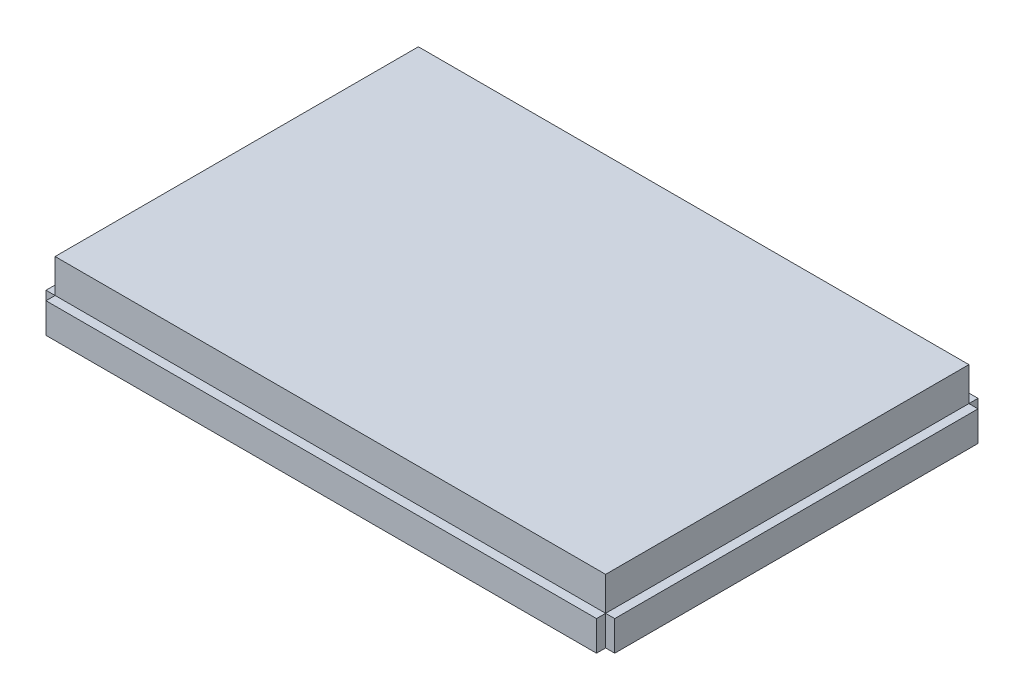
ISO-10303-21;
HEADER;
FILE_DESCRIPTION(('STEP AP214'),'2;1');
FILE_NAME('part.step','',(''),(''),'','','');
FILE_SCHEMA(('AUTOMOTIVE_DESIGN { 1 0 10303 214 1 1 1 1 }'));
ENDSEC;
DATA;
#1=APPLICATION_CONTEXT('core data for automotive mechanical design processes');
#2=APPLICATION_PROTOCOL_DEFINITION('international standard','automotive_design',2000,#1);
#3=PRODUCT_CONTEXT('',#1,'mechanical');
#4=PRODUCT('Part','Part','',(#3));
#5=PRODUCT_RELATED_PRODUCT_CATEGORY('part','',(#4));
#6=PRODUCT_DEFINITION_FORMATION('','',#4);
#7=PRODUCT_DEFINITION_CONTEXT('part definition',#1,'design');
#8=PRODUCT_DEFINITION('design','',#6,#7);
#9=PRODUCT_DEFINITION_SHAPE('','',#8);
#10=(LENGTH_UNIT() NAMED_UNIT(*) SI_UNIT(.MILLI.,.METRE.));
#11=(NAMED_UNIT(*) PLANE_ANGLE_UNIT() SI_UNIT($,.RADIAN.));
#12=(NAMED_UNIT(*) SI_UNIT($,.STERADIAN.) SOLID_ANGLE_UNIT());
#13=UNCERTAINTY_MEASURE_WITH_UNIT(LENGTH_MEASURE(1.E-05),#10,'distance_accuracy_value','');
#14=(GEOMETRIC_REPRESENTATION_CONTEXT(3) GLOBAL_UNCERTAINTY_ASSIGNED_CONTEXT((#13)) GLOBAL_UNIT_ASSIGNED_CONTEXT((#10,
#11,#12)) REPRESENTATION_CONTEXT('',''));
#15=CARTESIAN_POINT('',(0.,0.,0.));
#16=DIRECTION('',(0.,0.,1.));
#17=DIRECTION('',(1.,0.,0.));
#18=AXIS2_PLACEMENT_3D('',#15,#16,#17);
#19=CARTESIAN_POINT('',(-41.1099,9.525,27.1272));
#20=DIRECTION('',(1.,0.,0.));
#21=DIRECTION('',(0.,0.,-1.));
#22=AXIS2_PLACEMENT_3D('',#19,#20,#21);
#23=PLANE('',#22);
#24=DIRECTION('',(0.,0.,-1.));
#25=VECTOR('',#24,1.);
#26=CARTESIAN_POINT('',(-41.1099,4.4831,28.4861));
#27=LINE('',#26,#25);
#28=CARTESIAN_POINT('',(-41.1099,4.4831,28.4861));
#29=VERTEX_POINT('',#28);
#30=CARTESIAN_POINT('',(-41.1099,4.4831,27.1272));
#31=VERTEX_POINT('',#30);
#32=EDGE_CURVE('E232',#29,#31,#27,.T.);
#33=ORIENTED_EDGE('',*,*,#32,.T.);
#34=DIRECTION('',(0.,-1.,0.));
#35=VECTOR('',#34,1.);
#36=CARTESIAN_POINT('',(-41.1099,4.4831,27.1272));
#37=LINE('',#36,#35);
#38=CARTESIAN_POINT('',(-41.1099,0.,27.1272));
#39=VERTEX_POINT('',#38);
#40=EDGE_CURVE('E141',#31,#39,#37,.T.);
#41=ORIENTED_EDGE('',*,*,#40,.T.);
#42=DIRECTION('',(0.,0.,1.));
#43=VECTOR('',#42,1.);
#44=CARTESIAN_POINT('',(-41.1099,0.,27.1272));
#45=LINE('',#44,#43);
#46=CARTESIAN_POINT('',(-41.1099,0.,28.4861));
#47=VERTEX_POINT('',#46);
#48=EDGE_CURVE('E240',#39,#47,#45,.T.);
#49=ORIENTED_EDGE('',*,*,#48,.T.);
#50=DIRECTION('',(0.,-1.,0.));
#51=VECTOR('',#50,1.);
#52=CARTESIAN_POINT('',(-41.1099,4.4831,28.4861));
#53=LINE('',#52,#51);
#54=EDGE_CURVE('E222',#29,#47,#53,.T.);
#55=ORIENTED_EDGE('',*,*,#54,.F.);
#56=EDGE_LOOP('',(#33,#41,#49,#55));
#57=FACE_BOUND('',#56,.T.);
#58=ADVANCED_FACE('F33',(#57),#23,.F.);
#59=CARTESIAN_POINT('',(-41.1099,0.,-28.4861));
#60=VERTEX_POINT('',#59);
#61=CARTESIAN_POINT('',(-41.1099,0.,-27.1272));
#62=VERTEX_POINT('',#61);
#63=EDGE_CURVE('E251',#60,#62,#45,.T.);
#64=ORIENTED_EDGE('',*,*,#63,.T.);
#65=DIRECTION('',(0.,1.,0.));
#66=VECTOR('',#65,1.);
#67=CARTESIAN_POINT('',(-41.1099,4.4831,-27.1272));
#68=LINE('',#67,#66);
#69=CARTESIAN_POINT('',(-41.1099,4.4831,-27.1272));
#70=VERTEX_POINT('',#69);
#71=EDGE_CURVE('E157',#62,#70,#68,.T.);
#72=ORIENTED_EDGE('',*,*,#71,.T.);
#73=DIRECTION('',(0.,0.,1.));
#74=VECTOR('',#73,1.);
#75=CARTESIAN_POINT('',(-41.1099,4.4831,-28.4861));
#76=LINE('',#75,#74);
#77=CARTESIAN_POINT('',(-41.1099,4.4831,-28.4861));
#78=VERTEX_POINT('',#77);
#79=EDGE_CURVE('E218',#78,#70,#76,.T.);
#80=ORIENTED_EDGE('',*,*,#79,.F.);
#81=DIRECTION('',(0.,-1.,0.));
#82=VECTOR('',#81,1.);
#83=CARTESIAN_POINT('',(-41.1099,4.4831,-28.4861));
#84=LINE('',#83,#82);
#85=EDGE_CURVE('E202',#78,#60,#84,.T.);
#86=ORIENTED_EDGE('',*,*,#85,.T.);
#87=EDGE_LOOP('',(#64,#72,#80,#86));
#88=FACE_BOUND('',#87,.T.);
#89=ADVANCED_FACE('F315',(#88),#23,.F.);
#90=CARTESIAN_POINT('',(41.1099,9.525,27.1272));
#91=DIRECTION('',(-1.,0.,0.));
#92=DIRECTION('',(0.,0.,1.));
#93=AXIS2_PLACEMENT_3D('',#90,#91,#92);
#94=PLANE('',#93);
#95=DIRECTION('',(0.,-1.,0.));
#96=VECTOR('',#95,1.);
#97=CARTESIAN_POINT('',(41.1099,4.4831,27.1272));
#98=LINE('',#97,#96);
#99=CARTESIAN_POINT('',(41.1099,4.4831,27.1272));
#100=VERTEX_POINT('',#99);
#101=CARTESIAN_POINT('',(41.1099,0.,27.1272));
#102=VERTEX_POINT('',#101);
#103=EDGE_CURVE('E146',#100,#102,#98,.T.);
#104=ORIENTED_EDGE('',*,*,#103,.F.);
#105=DIRECTION('',(0.,0.,-1.));
#106=VECTOR('',#105,1.);
#107=CARTESIAN_POINT('',(41.1099,4.4831,28.4861));
#108=LINE('',#107,#106);
#109=CARTESIAN_POINT('',(41.1099,4.4831,28.4861));
#110=VERTEX_POINT('',#109);
#111=EDGE_CURVE('E237',#110,#100,#108,.T.);
#112=ORIENTED_EDGE('',*,*,#111,.F.);
#113=DIRECTION('',(0.,1.,0.));
#114=VECTOR('',#113,1.);
#115=CARTESIAN_POINT('',(41.1099,4.4831,28.4861));
#116=LINE('',#115,#114);
#117=CARTESIAN_POINT('',(41.1099,0.,28.4861));
#118=VERTEX_POINT('',#117);
#119=EDGE_CURVE('E228',#118,#110,#116,.T.);
#120=ORIENTED_EDGE('',*,*,#119,.F.);
#121=DIRECTION('',(0.,0.,-1.));
#122=VECTOR('',#121,1.);
#123=CARTESIAN_POINT('',(41.1099,0.,27.1272));
#124=LINE('',#123,#122);
#125=EDGE_CURVE('E56',#118,#102,#124,.T.);
#126=ORIENTED_EDGE('',*,*,#125,.T.);
#127=EDGE_LOOP('',(#104,#112,#120,#126));
#128=FACE_BOUND('',#127,.T.);
#129=ADVANCED_FACE('F317',(#128),#94,.F.);
#130=DIRECTION('',(0.,0.,1.));
#131=VECTOR('',#130,1.);
#132=CARTESIAN_POINT('',(41.1099,4.4831,27.1272));
#133=LINE('',#132,#131);
#134=CARTESIAN_POINT('',(41.1099,4.4831,-27.1272));
#135=VERTEX_POINT('',#134);
#136=EDGE_CURVE('E179',#135,#100,#133,.T.);
#137=ORIENTED_EDGE('',*,*,#136,.F.);
#138=DIRECTION('',(0.,-1.,0.));
#139=VECTOR('',#138,1.);
#140=CARTESIAN_POINT('',(41.1099,9.525,-27.1272));
#141=LINE('',#140,#139);
#142=CARTESIAN_POINT('',(41.1099,9.525,-27.1272));
#143=VERTEX_POINT('',#142);
#144=EDGE_CURVE('E258',#143,#135,#141,.T.);
#145=ORIENTED_EDGE('',*,*,#144,.F.);
#146=DIRECTION('',(0.,0.,-1.));
#147=VECTOR('',#146,1.);
#148=CARTESIAN_POINT('',(41.1099,9.525,27.1272));
#149=LINE('',#148,#147);
#150=CARTESIAN_POINT('',(41.1099,9.525,27.1272));
#151=VERTEX_POINT('',#150);
#152=EDGE_CURVE('E246',#151,#143,#149,.T.);
#153=ORIENTED_EDGE('',*,*,#152,.F.);
#154=DIRECTION('',(0.,-1.,0.));
#155=VECTOR('',#154,1.);
#156=CARTESIAN_POINT('',(41.1099,9.525,27.1272));
#157=LINE('',#156,#155);
#158=EDGE_CURVE('E41',#151,#100,#157,.T.);
#159=ORIENTED_EDGE('',*,*,#158,.T.);
#160=EDGE_LOOP('',(#137,#145,#153,#159));
#161=FACE_BOUND('',#160,.T.);
#162=ADVANCED_FACE('F264',(#161),#94,.F.);
#163=DIRECTION('',(0.,1.,0.));
#164=VECTOR('',#163,1.);
#165=CARTESIAN_POINT('',(41.1099,4.4831,-27.1272));
#166=LINE('',#165,#164);
#167=CARTESIAN_POINT('',(41.1099,0.,-27.1272));
#168=VERTEX_POINT('',#167);
#169=EDGE_CURVE('E48',#168,#135,#166,.T.);
#170=ORIENTED_EDGE('',*,*,#169,.F.);
#171=CARTESIAN_POINT('',(41.1099,0.,-28.4861));
#172=VERTEX_POINT('',#171);
#173=EDGE_CURVE('E254',#168,#172,#124,.T.);
#174=ORIENTED_EDGE('',*,*,#173,.T.);
#175=DIRECTION('',(0.,1.,0.));
#176=VECTOR('',#175,1.);
#177=CARTESIAN_POINT('',(41.1099,4.4831,-28.4861));
#178=LINE('',#177,#176);
#179=CARTESIAN_POINT('',(41.1099,4.4831,-28.4861));
#180=VERTEX_POINT('',#179);
#181=EDGE_CURVE('E208',#172,#180,#178,.T.);
#182=ORIENTED_EDGE('',*,*,#181,.T.);
#183=DIRECTION('',(0.,0.,1.));
#184=VECTOR('',#183,1.);
#185=CARTESIAN_POINT('',(41.1099,4.4831,-28.4861));
#186=LINE('',#185,#184);
#187=EDGE_CURVE('E214',#180,#135,#186,.T.);
#188=ORIENTED_EDGE('',*,*,#187,.T.);
#189=EDGE_LOOP('',(#170,#174,#182,#188));
#190=FACE_BOUND('',#189,.T.);
#191=ADVANCED_FACE('F292',(#190),#94,.F.);
#192=CARTESIAN_POINT('',(41.1099,9.525,27.1272));
#193=DIRECTION('',(0.,0.,-1.));
#194=DIRECTION('',(-1.,0.,0.));
#195=AXIS2_PLACEMENT_3D('',#192,#193,#194);
#196=PLANE('',#195);
#197=DIRECTION('',(-1.,0.,0.));
#198=VECTOR('',#197,1.);
#199=CARTESIAN_POINT('',(-41.1099,4.4831,27.1272));
#200=LINE('',#199,#198);
#201=EDGE_CURVE('E221',#100,#31,#200,.T.);
#202=ORIENTED_EDGE('',*,*,#201,.F.);
#203=ORIENTED_EDGE('',*,*,#158,.F.);
#204=DIRECTION('',(1.,0.,0.));
#205=VECTOR('',#204,1.);
#206=CARTESIAN_POINT('',(41.1099,9.525,27.1272));
#207=LINE('',#206,#205);
#208=CARTESIAN_POINT('',(-41.1099,9.525,27.1272));
#209=VERTEX_POINT('',#208);
#210=EDGE_CURVE('E244',#209,#151,#207,.T.);
#211=ORIENTED_EDGE('',*,*,#210,.F.);
#212=DIRECTION('',(0.,-1.,0.));
#213=VECTOR('',#212,1.);
#214=CARTESIAN_POINT('',(-41.1099,9.525,27.1272));
#215=LINE('',#214,#213);
#216=EDGE_CURVE('E11',#209,#31,#215,.T.);
#217=ORIENTED_EDGE('',*,*,#216,.T.);
#218=EDGE_LOOP('',(#202,#203,#211,#217));
#219=FACE_BOUND('',#218,.T.);
#220=ADVANCED_FACE('F309',(#219),#196,.F.);
#221=DIRECTION('',(0.,-1.,0.));
#222=VECTOR('',#221,1.);
#223=CARTESIAN_POINT('',(-41.1099,9.525,-27.1272));
#224=LINE('',#223,#222);
#225=CARTESIAN_POINT('',(-41.1099,9.525,-27.1272));
#226=VERTEX_POINT('',#225);
#227=EDGE_CURVE('E250',#226,#70,#224,.T.);
#228=ORIENTED_EDGE('',*,*,#227,.T.);
#229=DIRECTION('',(0.,0.,1.));
#230=VECTOR('',#229,1.);
#231=CARTESIAN_POINT('',(-41.1099,4.4831,27.1272));
#232=LINE('',#231,#230);
#233=EDGE_CURVE('E167',#70,#31,#232,.T.);
#234=ORIENTED_EDGE('',*,*,#233,.T.);
#235=ORIENTED_EDGE('',*,*,#216,.F.);
#236=DIRECTION('',(0.,0.,1.));
#237=VECTOR('',#236,1.);
#238=CARTESIAN_POINT('',(-41.1099,9.525,27.1272));
#239=LINE('',#238,#237);
#240=EDGE_CURVE('E241',#226,#209,#239,.T.);
#241=ORIENTED_EDGE('',*,*,#240,.F.);
#242=EDGE_LOOP('',(#228,#234,#235,#241));
#243=FACE_BOUND('',#242,.T.);
#244=ADVANCED_FACE('F35',(#243),#23,.F.);
#245=CARTESIAN_POINT('',(41.1099,9.525,-27.1272));
#246=DIRECTION('',(0.,0.,1.));
#247=DIRECTION('',(1.,0.,0.));
#248=AXIS2_PLACEMENT_3D('',#245,#246,#247);
#249=PLANE('',#248);
#250=ORIENTED_EDGE('',*,*,#144,.T.);
#251=DIRECTION('',(-1.,0.,0.));
#252=VECTOR('',#251,1.);
#253=CARTESIAN_POINT('',(-41.1099,4.4831,-27.1272));
#254=LINE('',#253,#252);
#255=EDGE_CURVE('E201',#135,#70,#254,.T.);
#256=ORIENTED_EDGE('',*,*,#255,.T.);
#257=ORIENTED_EDGE('',*,*,#227,.F.);
#258=DIRECTION('',(-1.,0.,0.));
#259=VECTOR('',#258,1.);
#260=CARTESIAN_POINT('',(41.1099,9.525,-27.1272));
#261=LINE('',#260,#259);
#262=EDGE_CURVE('E248',#143,#226,#261,.T.);
#263=ORIENTED_EDGE('',*,*,#262,.F.);
#264=EDGE_LOOP('',(#250,#256,#257,#263));
#265=FACE_BOUND('',#264,.T.);
#266=ADVANCED_FACE('F302',(#265),#249,.F.);
#267=CARTESIAN_POINT('',(0.,9.525,0.));
#268=DIRECTION('',(0.,1.,0.));
#269=DIRECTION('',(0.,0.,1.));
#270=AXIS2_PLACEMENT_3D('',#267,#268,#269);
#271=PLANE('',#270);
#272=ORIENTED_EDGE('',*,*,#240,.T.);
#273=ORIENTED_EDGE('',*,*,#210,.T.);
#274=ORIENTED_EDGE('',*,*,#152,.T.);
#275=ORIENTED_EDGE('',*,*,#262,.T.);
#276=EDGE_LOOP('',(#272,#273,#274,#275));
#277=FACE_BOUND('',#276,.T.);
#278=ADVANCED_FACE('F308',(#277),#271,.T.);
#279=CARTESIAN_POINT('',(0.,0.,0.));
#280=DIRECTION('',(0.,1.,0.));
#281=DIRECTION('',(0.,0.,1.));
#282=AXIS2_PLACEMENT_3D('',#279,#280,#281);
#283=PLANE('',#282);
#284=ORIENTED_EDGE('',*,*,#63,.F.);
#285=DIRECTION('',(1.,0.,0.));
#286=VECTOR('',#285,1.);
#287=CARTESIAN_POINT('',(-41.1099,0.,-28.4861));
#288=LINE('',#287,#286);
#289=EDGE_CURVE('E211',#60,#172,#288,.T.);
#290=ORIENTED_EDGE('',*,*,#289,.T.);
#291=ORIENTED_EDGE('',*,*,#173,.F.);
#292=DIRECTION('',(-1.,0.,0.));
#293=VECTOR('',#292,1.);
#294=CARTESIAN_POINT('',(42.4688,0.,-27.1272));
#295=LINE('',#294,#293);
#296=CARTESIAN_POINT('',(42.4688,0.,-27.1272));
#297=VERTEX_POINT('',#296);
#298=EDGE_CURVE('E196',#297,#168,#295,.T.);
#299=ORIENTED_EDGE('',*,*,#298,.F.);
#300=DIRECTION('',(0.,0.,-1.));
#301=VECTOR('',#300,1.);
#302=CARTESIAN_POINT('',(42.4688,0.,27.1272));
#303=LINE('',#302,#301);
#304=CARTESIAN_POINT('',(42.4688,0.,27.1272));
#305=VERTEX_POINT('',#304);
#306=EDGE_CURVE('E178',#305,#297,#303,.T.);
#307=ORIENTED_EDGE('',*,*,#306,.F.);
#308=DIRECTION('',(-1.,0.,0.));
#309=VECTOR('',#308,1.);
#310=CARTESIAN_POINT('',(42.4688,0.,27.1272));
#311=LINE('',#310,#309);
#312=EDGE_CURVE('E199',#305,#102,#311,.T.);
#313=ORIENTED_EDGE('',*,*,#312,.T.);
#314=ORIENTED_EDGE('',*,*,#125,.F.);
#315=DIRECTION('',(1.,0.,0.));
#316=VECTOR('',#315,1.);
#317=CARTESIAN_POINT('',(-41.1099,0.,28.4861));
#318=LINE('',#317,#316);
#319=EDGE_CURVE('E225',#47,#118,#318,.T.);
#320=ORIENTED_EDGE('',*,*,#319,.F.);
#321=ORIENTED_EDGE('',*,*,#48,.F.);
#322=DIRECTION('',(1.,0.,0.));
#323=VECTOR('',#322,1.);
#324=CARTESIAN_POINT('',(-42.4688,0.,27.1272));
#325=LINE('',#324,#323);
#326=CARTESIAN_POINT('',(-42.4688,0.,27.1272));
#327=VERTEX_POINT('',#326);
#328=EDGE_CURVE('E165',#327,#39,#325,.T.);
#329=ORIENTED_EDGE('',*,*,#328,.F.);
#330=DIRECTION('',(0.,0.,-1.));
#331=VECTOR('',#330,1.);
#332=CARTESIAN_POINT('',(-42.4688,0.,27.1272));
#333=LINE('',#332,#331);
#334=CARTESIAN_POINT('',(-42.4688,0.,-27.1272));
#335=VERTEX_POINT('',#334);
#336=EDGE_CURVE('E156',#327,#335,#333,.T.);
#337=ORIENTED_EDGE('',*,*,#336,.T.);
#338=DIRECTION('',(1.,0.,0.));
#339=VECTOR('',#338,1.);
#340=CARTESIAN_POINT('',(-42.4688,0.,-27.1272));
#341=LINE('',#340,#339);
#342=EDGE_CURVE('E172',#335,#62,#341,.T.);
#343=ORIENTED_EDGE('',*,*,#342,.T.);
#344=EDGE_LOOP('',(#284,#290,#291,#299,#307,#313,#314,#320,#321,#329,#337,#343));
#345=FACE_BOUND('',#344,.T.);
#346=ADVANCED_FACE('F289',(#345),#283,.F.);
#347=CARTESIAN_POINT('',(-41.1099,4.4831,28.4861));
#348=DIRECTION('',(0.,-1.,0.));
#349=DIRECTION('',(0.,0.,-1.));
#350=AXIS2_PLACEMENT_3D('',#347,#348,#349);
#351=PLANE('',#350);
#352=ORIENTED_EDGE('',*,*,#201,.T.);
#353=ORIENTED_EDGE('',*,*,#32,.F.);
#354=DIRECTION('',(-1.,0.,0.));
#355=VECTOR('',#354,1.);
#356=CARTESIAN_POINT('',(-41.1099,4.4831,28.4861));
#357=LINE('',#356,#355);
#358=EDGE_CURVE('E230',#110,#29,#357,.T.);
#359=ORIENTED_EDGE('',*,*,#358,.F.);
#360=ORIENTED_EDGE('',*,*,#111,.T.);
#361=EDGE_LOOP('',(#352,#353,#359,#360));
#362=FACE_BOUND('',#361,.T.);
#363=ADVANCED_FACE('F271',(#362),#351,.F.);
#364=CARTESIAN_POINT('',(0.,0.,28.4861));
#365=DIRECTION('',(0.,0.,1.));
#366=DIRECTION('',(1.,0.,0.));
#367=AXIS2_PLACEMENT_3D('',#364,#365,#366);
#368=PLANE('',#367);
#369=ORIENTED_EDGE('',*,*,#54,.T.);
#370=ORIENTED_EDGE('',*,*,#319,.T.);
#371=ORIENTED_EDGE('',*,*,#119,.T.);
#372=ORIENTED_EDGE('',*,*,#358,.T.);
#373=EDGE_LOOP('',(#369,#370,#371,#372));
#374=FACE_BOUND('',#373,.T.);
#375=ADVANCED_FACE('F328',(#374),#368,.T.);
#376=CARTESIAN_POINT('',(-41.1099,4.4831,-28.4861));
#377=DIRECTION('',(0.,1.,0.));
#378=DIRECTION('',(0.,0.,1.));
#379=AXIS2_PLACEMENT_3D('',#376,#377,#378);
#380=PLANE('',#379);
#381=ORIENTED_EDGE('',*,*,#255,.F.);
#382=ORIENTED_EDGE('',*,*,#187,.F.);
#383=DIRECTION('',(-1.,0.,0.));
#384=VECTOR('',#383,1.);
#385=CARTESIAN_POINT('',(-41.1099,4.4831,-28.4861));
#386=LINE('',#385,#384);
#387=EDGE_CURVE('E205',#180,#78,#386,.T.);
#388=ORIENTED_EDGE('',*,*,#387,.T.);
#389=ORIENTED_EDGE('',*,*,#79,.T.);
#390=EDGE_LOOP('',(#381,#382,#388,#389));
#391=FACE_BOUND('',#390,.T.);
#392=ADVANCED_FACE('F299',(#391),#380,.T.);
#393=CARTESIAN_POINT('',(0.,0.,-28.4861));
#394=DIRECTION('',(0.,0.,-1.));
#395=DIRECTION('',(1.,0.,0.));
#396=AXIS2_PLACEMENT_3D('',#393,#394,#395);
#397=PLANE('',#396);
#398=ORIENTED_EDGE('',*,*,#85,.F.);
#399=ORIENTED_EDGE('',*,*,#387,.F.);
#400=ORIENTED_EDGE('',*,*,#181,.F.);
#401=ORIENTED_EDGE('',*,*,#289,.F.);
#402=EDGE_LOOP('',(#398,#399,#400,#401));
#403=FACE_BOUND('',#402,.T.);
#404=ADVANCED_FACE('F296',(#403),#397,.T.);
#405=CARTESIAN_POINT('',(42.4688,4.4831,27.1272));
#406=DIRECTION('',(0.,0.,-1.));
#407=DIRECTION('',(-1.,0.,0.));
#408=AXIS2_PLACEMENT_3D('',#405,#406,#407);
#409=PLANE('',#408);
#410=ORIENTED_EDGE('',*,*,#103,.T.);
#411=ORIENTED_EDGE('',*,*,#312,.F.);
#412=DIRECTION('',(0.,-1.,0.));
#413=VECTOR('',#412,1.);
#414=CARTESIAN_POINT('',(42.4688,4.4831,27.1272));
#415=LINE('',#414,#413);
#416=CARTESIAN_POINT('',(42.4688,4.4831,27.1272));
#417=VERTEX_POINT('',#416);
#418=EDGE_CURVE('E175',#417,#305,#415,.T.);
#419=ORIENTED_EDGE('',*,*,#418,.F.);
#420=DIRECTION('',(-1.,0.,0.));
#421=VECTOR('',#420,1.);
#422=CARTESIAN_POINT('',(42.4688,4.4831,27.1272));
#423=LINE('',#422,#421);
#424=EDGE_CURVE('E185',#417,#100,#423,.T.);
#425=ORIENTED_EDGE('',*,*,#424,.T.);
#426=EDGE_LOOP('',(#410,#411,#419,#425));
#427=FACE_BOUND('',#426,.T.);
#428=ADVANCED_FACE('F280',(#427),#409,.F.);
#429=CARTESIAN_POINT('',(42.4688,4.4831,-27.1272));
#430=DIRECTION('',(0.,0.,1.));
#431=DIRECTION('',(1.,0.,0.));
#432=AXIS2_PLACEMENT_3D('',#429,#430,#431);
#433=PLANE('',#432);
#434=ORIENTED_EDGE('',*,*,#169,.T.);
#435=DIRECTION('',(-1.,0.,0.));
#436=VECTOR('',#435,1.);
#437=CARTESIAN_POINT('',(42.4688,4.4831,-27.1272));
#438=LINE('',#437,#436);
#439=CARTESIAN_POINT('',(42.4688,4.4831,-27.1272));
#440=VERTEX_POINT('',#439);
#441=EDGE_CURVE('E193',#440,#135,#438,.T.);
#442=ORIENTED_EDGE('',*,*,#441,.F.);
#443=DIRECTION('',(0.,1.,0.));
#444=VECTOR('',#443,1.);
#445=CARTESIAN_POINT('',(42.4688,4.4831,-27.1272));
#446=LINE('',#445,#444);
#447=EDGE_CURVE('E181',#297,#440,#446,.T.);
#448=ORIENTED_EDGE('',*,*,#447,.F.);
#449=ORIENTED_EDGE('',*,*,#298,.T.);
#450=EDGE_LOOP('',(#434,#442,#448,#449));
#451=FACE_BOUND('',#450,.T.);
#452=ADVANCED_FACE('F287',(#451),#433,.F.);
#453=CARTESIAN_POINT('',(42.4688,4.4831,27.1272));
#454=DIRECTION('',(0.,-1.,0.));
#455=DIRECTION('',(0.,0.,-1.));
#456=AXIS2_PLACEMENT_3D('',#453,#454,#455);
#457=PLANE('',#456);
#458=ORIENTED_EDGE('',*,*,#136,.T.);
#459=ORIENTED_EDGE('',*,*,#424,.F.);
#460=DIRECTION('',(0.,0.,1.));
#461=VECTOR('',#460,1.);
#462=CARTESIAN_POINT('',(42.4688,4.4831,27.1272));
#463=LINE('',#462,#461);
#464=EDGE_CURVE('E183',#440,#417,#463,.T.);
#465=ORIENTED_EDGE('',*,*,#464,.F.);
#466=ORIENTED_EDGE('',*,*,#441,.T.);
#467=EDGE_LOOP('',(#458,#459,#465,#466));
#468=FACE_BOUND('',#467,.T.);
#469=ADVANCED_FACE('F275',(#468),#457,.F.);
#470=CARTESIAN_POINT('',(42.4688,0.,0.));
#471=DIRECTION('',(1.,0.,0.));
#472=DIRECTION('',(0.,0.,-1.));
#473=AXIS2_PLACEMENT_3D('',#470,#471,#472);
#474=PLANE('',#473);
#475=ORIENTED_EDGE('',*,*,#418,.T.);
#476=ORIENTED_EDGE('',*,*,#306,.T.);
#477=ORIENTED_EDGE('',*,*,#447,.T.);
#478=ORIENTED_EDGE('',*,*,#464,.T.);
#479=EDGE_LOOP('',(#475,#476,#477,#478));
#480=FACE_BOUND('',#479,.T.);
#481=ADVANCED_FACE('F283',(#480),#474,.T.);
#482=CARTESIAN_POINT('',(-42.4688,4.4831,27.1272));
#483=DIRECTION('',(0.,0.,1.));
#484=DIRECTION('',(1.,0.,0.));
#485=AXIS2_PLACEMENT_3D('',#482,#483,#484);
#486=PLANE('',#485);
#487=ORIENTED_EDGE('',*,*,#40,.F.);
#488=DIRECTION('',(1.,0.,0.));
#489=VECTOR('',#488,1.);
#490=CARTESIAN_POINT('',(-42.4688,4.4831,27.1272));
#491=LINE('',#490,#489);
#492=CARTESIAN_POINT('',(-42.4688,4.4831,27.1272));
#493=VERTEX_POINT('',#492);
#494=EDGE_CURVE('E135',#493,#31,#491,.T.);
#495=ORIENTED_EDGE('',*,*,#494,.F.);
#496=DIRECTION('',(0.,-1.,0.));
#497=VECTOR('',#496,1.);
#498=CARTESIAN_POINT('',(-42.4688,4.4831,27.1272));
#499=LINE('',#498,#497);
#500=EDGE_CURVE('E138',#493,#327,#499,.T.);
#501=ORIENTED_EDGE('',*,*,#500,.T.);
#502=ORIENTED_EDGE('',*,*,#328,.T.);
#503=EDGE_LOOP('',(#487,#495,#501,#502));
#504=FACE_BOUND('',#503,.T.);
#505=ADVANCED_FACE('F137',(#504),#486,.T.);
#506=CARTESIAN_POINT('',(-42.4688,4.4831,27.1272));
#507=DIRECTION('',(0.,1.,0.));
#508=DIRECTION('',(0.,0.,1.));
#509=AXIS2_PLACEMENT_3D('',#506,#507,#508);
#510=PLANE('',#509);
#511=ORIENTED_EDGE('',*,*,#233,.F.);
#512=DIRECTION('',(1.,0.,0.));
#513=VECTOR('',#512,1.);
#514=CARTESIAN_POINT('',(-42.4688,4.4831,-27.1272));
#515=LINE('',#514,#513);
#516=CARTESIAN_POINT('',(-42.4688,4.4831,-27.1272));
#517=VERTEX_POINT('',#516);
#518=EDGE_CURVE('E147',#517,#70,#515,.T.);
#519=ORIENTED_EDGE('',*,*,#518,.F.);
#520=DIRECTION('',(0.,0.,1.));
#521=VECTOR('',#520,1.);
#522=CARTESIAN_POINT('',(-42.4688,4.4831,27.1272));
#523=LINE('',#522,#521);
#524=EDGE_CURVE('E153',#517,#493,#523,.T.);
#525=ORIENTED_EDGE('',*,*,#524,.T.);
#526=ORIENTED_EDGE('',*,*,#494,.T.);
#527=EDGE_LOOP('',(#511,#519,#525,#526));
#528=FACE_BOUND('',#527,.T.);
#529=ADVANCED_FACE('F159',(#528),#510,.T.);
#530=CARTESIAN_POINT('',(-42.4688,4.4831,-27.1272));
#531=DIRECTION('',(0.,0.,-1.));
#532=DIRECTION('',(-1.,0.,0.));
#533=AXIS2_PLACEMENT_3D('',#530,#531,#532);
#534=PLANE('',#533);
#535=ORIENTED_EDGE('',*,*,#71,.F.);
#536=ORIENTED_EDGE('',*,*,#342,.F.);
#537=DIRECTION('',(0.,1.,0.));
#538=VECTOR('',#537,1.);
#539=CARTESIAN_POINT('',(-42.4688,4.4831,-27.1272));
#540=LINE('',#539,#538);
#541=EDGE_CURVE('E160',#335,#517,#540,.T.);
#542=ORIENTED_EDGE('',*,*,#541,.T.);
#543=ORIENTED_EDGE('',*,*,#518,.T.);
#544=EDGE_LOOP('',(#535,#536,#542,#543));
#545=FACE_BOUND('',#544,.T.);
#546=ADVANCED_FACE('F360',(#545),#534,.T.);
#547=CARTESIAN_POINT('',(-42.4688,0.,0.));
#548=DIRECTION('',(-1.,0.,0.));
#549=DIRECTION('',(0.,0.,-1.));
#550=AXIS2_PLACEMENT_3D('',#547,#548,#549);
#551=PLANE('',#550);
#552=ORIENTED_EDGE('',*,*,#500,.F.);
#553=ORIENTED_EDGE('',*,*,#524,.F.);
#554=ORIENTED_EDGE('',*,*,#541,.F.);
#555=ORIENTED_EDGE('',*,*,#336,.F.);
#556=EDGE_LOOP('',(#552,#553,#554,#555));
#557=FACE_BOUND('',#556,.T.);
#558=ADVANCED_FACE('F151',(#557),#551,.T.);
#559=CLOSED_SHELL('',(#58,#89,#129,#162,#191,#220,#244,#266,#278,#346,#363,#375,#392,#404,#428,
#452,#469,#481,#505,#529,#546,#558));
#560=MANIFOLD_SOLID_BREP('B2',#559);
#561=ADVANCED_BREP_SHAPE_REPRESENTATION('',(#18,#560),#14);
#562=SHAPE_DEFINITION_REPRESENTATION(#9,#561);
ENDSEC;
END-ISO-10303-21;
